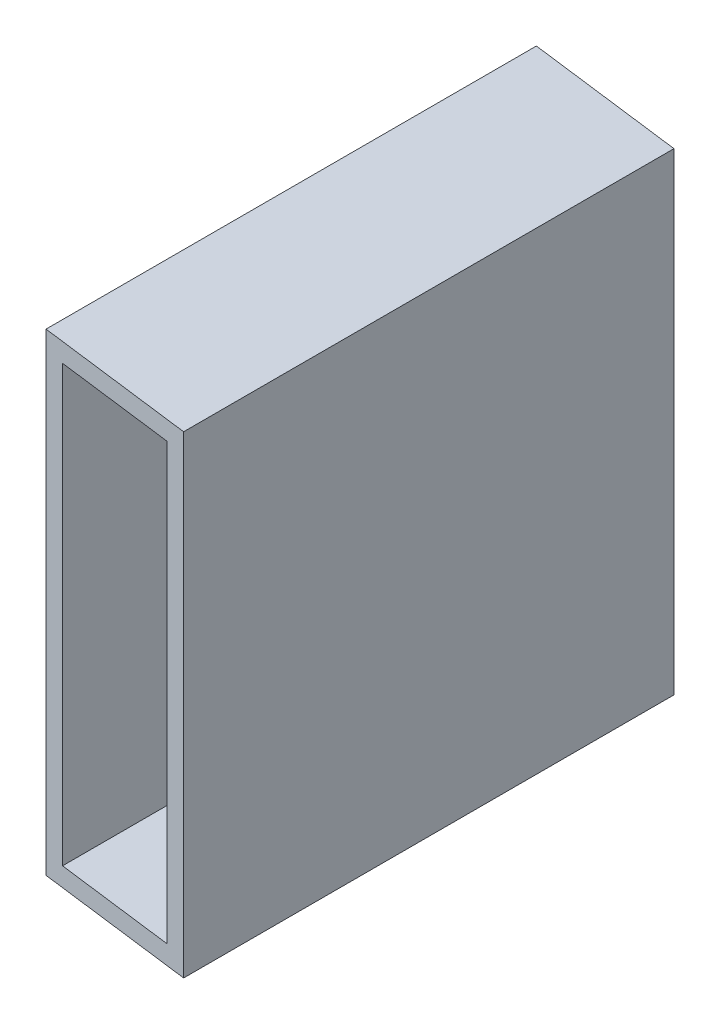
ISO-10303-21;
HEADER;
FILE_DESCRIPTION(('STEP AP214'),'2;1');
FILE_NAME('part.step','',(''),(''),'','','');
FILE_SCHEMA(('AUTOMOTIVE_DESIGN { 1 0 10303 214 1 1 1 1 }'));
ENDSEC;
DATA;
#1=APPLICATION_CONTEXT('core data for automotive mechanical design processes');
#2=APPLICATION_PROTOCOL_DEFINITION('international standard','automotive_design',2000,#1);
#3=PRODUCT_CONTEXT('',#1,'mechanical');
#4=PRODUCT('Part','Part','',(#3));
#5=PRODUCT_RELATED_PRODUCT_CATEGORY('part','',(#4));
#6=PRODUCT_DEFINITION_FORMATION('','',#4);
#7=PRODUCT_DEFINITION_CONTEXT('part definition',#1,'design');
#8=PRODUCT_DEFINITION('design','',#6,#7);
#9=PRODUCT_DEFINITION_SHAPE('','',#8);
#10=(LENGTH_UNIT() NAMED_UNIT(*) SI_UNIT(.MILLI.,.METRE.));
#11=(NAMED_UNIT(*) PLANE_ANGLE_UNIT() SI_UNIT($,.RADIAN.));
#12=(NAMED_UNIT(*) SI_UNIT($,.STERADIAN.) SOLID_ANGLE_UNIT());
#13=UNCERTAINTY_MEASURE_WITH_UNIT(LENGTH_MEASURE(1.E-05),#10,'distance_accuracy_value','');
#14=(GEOMETRIC_REPRESENTATION_CONTEXT(3) GLOBAL_UNCERTAINTY_ASSIGNED_CONTEXT((#13)) GLOBAL_UNIT_ASSIGNED_CONTEXT((#10,
#11,#12)) REPRESENTATION_CONTEXT('',''));
#15=CARTESIAN_POINT('',(0.,0.,0.));
#16=DIRECTION('',(0.,0.,1.));
#17=DIRECTION('',(1.,0.,0.));
#18=AXIS2_PLACEMENT_3D('',#15,#16,#17);
#19=CARTESIAN_POINT('',(12.7000000000001,0.,78.9851209117244));
#20=DIRECTION('',(-1.,0.,0.));
#21=DIRECTION('',(0.,-1.,0.));
#22=AXIS2_PLACEMENT_3D('',#19,#20,#21);
#23=PLANE('',#22);
#24=DIRECTION('',(0.,1.,0.));
#25=VECTOR('',#24,1.);
#26=CARTESIAN_POINT('',(12.7000000000001,0.,80.6027654223491));
#27=LINE('',#26,#25);
#28=CARTESIAN_POINT('',(12.7,-38.1,80.6027654223491));
#29=VERTEX_POINT('',#28);
#30=CARTESIAN_POINT('',(12.7,38.1,80.6027654223491));
#31=VERTEX_POINT('',#30);
#32=EDGE_CURVE('E99',#29,#31,#27,.T.);
#33=ORIENTED_EDGE('',*,*,#32,.F.);
#34=DIRECTION('',(0.,0.,-1.));
#35=VECTOR('',#34,1.);
#36=CARTESIAN_POINT('',(12.7,-38.1,78.9851209117244));
#37=LINE('',#36,#35);
#38=CARTESIAN_POINT('',(12.7,-38.1,1.61764451062471));
#39=VERTEX_POINT('',#38);
#40=EDGE_CURVE('E109',#29,#39,#37,.T.);
#41=ORIENTED_EDGE('',*,*,#40,.T.);
#42=DIRECTION('',(0.,-1.,0.));
#43=VECTOR('',#42,1.);
#44=CARTESIAN_POINT('',(12.7000000000001,0.,1.61764451062471));
#45=LINE('',#44,#43);
#46=CARTESIAN_POINT('',(12.7,38.1,1.6176445106247));
#47=VERTEX_POINT('',#46);
#48=EDGE_CURVE('E156',#47,#39,#45,.T.);
#49=ORIENTED_EDGE('',*,*,#48,.F.);
#50=DIRECTION('',(0.,0.,-1.));
#51=VECTOR('',#50,1.);
#52=CARTESIAN_POINT('',(12.7,38.1,78.9851209117244));
#53=LINE('',#52,#51);
#54=EDGE_CURVE('E42',#31,#47,#53,.T.);
#55=ORIENTED_EDGE('',*,*,#54,.F.);
#56=EDGE_LOOP('',(#33,#41,#49,#55));
#57=FACE_BOUND('',#56,.T.);
#58=ADVANCED_FACE('F34',(#57),#23,.F.);
#59=CARTESIAN_POINT('',(0.,38.1,78.9851209117244));
#60=DIRECTION('',(0.,1.,0.));
#61=DIRECTION('',(0.,0.,1.));
#62=AXIS2_PLACEMENT_3D('',#59,#60,#61);
#63=PLANE('',#62);
#64=DIRECTION('',(0.,0.,-1.));
#65=VECTOR('',#64,1.);
#66=CARTESIAN_POINT('',(-12.7,38.1,78.9851209117244));
#67=LINE('',#66,#65);
#68=CARTESIAN_POINT('',(-12.7,38.1,77.3674764010997));
#69=VERTEX_POINT('',#68);
#70=CARTESIAN_POINT('',(-12.7,38.1,-1.6176445106247));
#71=VERTEX_POINT('',#70);
#72=EDGE_CURVE('E119',#69,#71,#67,.T.);
#73=ORIENTED_EDGE('',*,*,#72,.F.);
#74=DIRECTION('',(0.991985376438617,0.,0.126352732190228));
#75=VECTOR('',#74,1.);
#76=CARTESIAN_POINT('',(0.,38.1,78.9851209117244));
#77=LINE('',#76,#75);
#78=EDGE_CURVE('E112',#69,#31,#77,.T.);
#79=ORIENTED_EDGE('',*,*,#78,.T.);
#80=ORIENTED_EDGE('',*,*,#54,.T.);
#81=DIRECTION('',(0.991985376438617,0.,0.126352732190229));
#82=VECTOR('',#81,1.);
#83=CARTESIAN_POINT('',(0.,38.1,0.));
#84=LINE('',#83,#82);
#85=EDGE_CURVE('E111',#71,#47,#84,.T.);
#86=ORIENTED_EDGE('',*,*,#85,.F.);
#87=EDGE_LOOP('',(#73,#79,#80,#86));
#88=FACE_BOUND('',#87,.T.);
#89=ADVANCED_FACE('F185',(#88),#63,.T.);
#90=CARTESIAN_POINT('',(-12.7,0.,78.9851209117244));
#91=DIRECTION('',(-1.,0.,0.));
#92=DIRECTION('',(0.,0.,1.));
#93=AXIS2_PLACEMENT_3D('',#90,#91,#92);
#94=PLANE('',#93);
#95=DIRECTION('',(0.,0.,-1.));
#96=VECTOR('',#95,1.);
#97=CARTESIAN_POINT('',(-12.7,-38.1,78.9851209117244));
#98=LINE('',#97,#96);
#99=CARTESIAN_POINT('',(-12.7,-38.1,77.3674764010997));
#100=VERTEX_POINT('',#99);
#101=CARTESIAN_POINT('',(-12.7,-38.1,-1.61764451062471));
#102=VERTEX_POINT('',#101);
#103=EDGE_CURVE('E116',#100,#102,#98,.T.);
#104=ORIENTED_EDGE('',*,*,#103,.F.);
#105=DIRECTION('',(0.,1.,0.));
#106=VECTOR('',#105,1.);
#107=CARTESIAN_POINT('',(-12.7,0.,77.3674764010997));
#108=LINE('',#107,#106);
#109=EDGE_CURVE('E57',#100,#69,#108,.T.);
#110=ORIENTED_EDGE('',*,*,#109,.T.);
#111=ORIENTED_EDGE('',*,*,#72,.T.);
#112=DIRECTION('',(0.,-1.,0.));
#113=VECTOR('',#112,1.);
#114=CARTESIAN_POINT('',(-12.7,0.,-1.6176445106247));
#115=LINE('',#114,#113);
#116=EDGE_CURVE('E158',#71,#102,#115,.T.);
#117=ORIENTED_EDGE('',*,*,#116,.T.);
#118=EDGE_LOOP('',(#104,#110,#111,#117));
#119=FACE_BOUND('',#118,.T.);
#120=ADVANCED_FACE('F189',(#119),#94,.T.);
#121=CARTESIAN_POINT('',(9.652,0.,78.9851209117244));
#122=DIRECTION('',(1.,0.,0.));
#123=DIRECTION('',(0.,1.,0.));
#124=AXIS2_PLACEMENT_3D('',#121,#122,#123);
#125=PLANE('',#124);
#126=DIRECTION('',(0.,-1.,0.));
#127=VECTOR('',#126,1.);
#128=CARTESIAN_POINT('',(9.652,0.,80.2145307397992));
#129=LINE('',#128,#127);
#130=CARTESIAN_POINT('',(9.652,35.052,80.2145307397992));
#131=VERTEX_POINT('',#130);
#132=CARTESIAN_POINT('',(9.652,-35.052,80.2145307397992));
#133=VERTEX_POINT('',#132);
#134=EDGE_CURVE('E165',#131,#133,#129,.T.);
#135=ORIENTED_EDGE('',*,*,#134,.F.);
#136=DIRECTION('',(0.,0.,-1.));
#137=VECTOR('',#136,1.);
#138=CARTESIAN_POINT('',(9.65199999999999,35.052,78.9851209117244));
#139=LINE('',#138,#137);
#140=CARTESIAN_POINT('',(9.652,35.052,1.22940982807478));
#141=VERTEX_POINT('',#140);
#142=EDGE_CURVE('E128',#131,#141,#139,.T.);
#143=ORIENTED_EDGE('',*,*,#142,.T.);
#144=DIRECTION('',(0.,1.,0.));
#145=VECTOR('',#144,1.);
#146=CARTESIAN_POINT('',(9.652,0.,1.22940982807478));
#147=LINE('',#146,#145);
#148=CARTESIAN_POINT('',(9.652,-35.052,1.22940982807477));
#149=VERTEX_POINT('',#148);
#150=EDGE_CURVE('E123',#149,#141,#147,.T.);
#151=ORIENTED_EDGE('',*,*,#150,.F.);
#152=DIRECTION('',(0.,0.,-1.));
#153=VECTOR('',#152,1.);
#154=CARTESIAN_POINT('',(9.652,-35.052,78.9851209117244));
#155=LINE('',#154,#153);
#156=EDGE_CURVE('E117',#133,#149,#155,.T.);
#157=ORIENTED_EDGE('',*,*,#156,.F.);
#158=EDGE_LOOP('',(#135,#143,#151,#157));
#159=FACE_BOUND('',#158,.T.);
#160=ADVANCED_FACE('F36',(#159),#125,.F.);
#161=CARTESIAN_POINT('',(0.,-35.052,78.9851209117244));
#162=DIRECTION('',(0.,1.,0.));
#163=DIRECTION('',(-1.,0.,0.));
#164=AXIS2_PLACEMENT_3D('',#161,#162,#163);
#165=PLANE('',#164);
#166=DIRECTION('',(0.,0.,-1.));
#167=VECTOR('',#166,1.);
#168=CARTESIAN_POINT('',(-9.65199999999999,-35.052,78.9851209117244));
#169=LINE('',#168,#167);
#170=CARTESIAN_POINT('',(-9.65199999999999,-35.052,77.7557110836497));
#171=VERTEX_POINT('',#170);
#172=CARTESIAN_POINT('',(-9.65199999999999,-35.052,-1.22940982807478));
#173=VERTEX_POINT('',#172);
#174=EDGE_CURVE('E121',#171,#173,#169,.T.);
#175=ORIENTED_EDGE('',*,*,#174,.F.);
#176=DIRECTION('',(0.991985376438617,0.,0.126352732190228));
#177=VECTOR('',#176,1.);
#178=CARTESIAN_POINT('',(0.,-35.052,78.9851209117244));
#179=LINE('',#178,#177);
#180=EDGE_CURVE('E167',#171,#133,#179,.T.);
#181=ORIENTED_EDGE('',*,*,#180,.T.);
#182=ORIENTED_EDGE('',*,*,#156,.T.);
#183=DIRECTION('',(-0.991985376438617,0.,-0.126352732190229));
#184=VECTOR('',#183,1.);
#185=CARTESIAN_POINT('',(9.9,-35.052,1.26099847678618));
#186=LINE('',#185,#184);
#187=EDGE_CURVE('E147',#149,#173,#186,.T.);
#188=ORIENTED_EDGE('',*,*,#187,.T.);
#189=EDGE_LOOP('',(#175,#181,#182,#188));
#190=FACE_BOUND('',#189,.T.);
#191=ADVANCED_FACE('F152',(#190),#165,.T.);
#192=CARTESIAN_POINT('',(-9.65199999999999,0.,78.9851209117244));
#193=DIRECTION('',(1.,0.,0.));
#194=DIRECTION('',(0.,1.,0.));
#195=AXIS2_PLACEMENT_3D('',#192,#193,#194);
#196=PLANE('',#195);
#197=DIRECTION('',(0.,0.,-1.));
#198=VECTOR('',#197,1.);
#199=CARTESIAN_POINT('',(-9.65199999999999,35.052,78.9851209117244));
#200=LINE('',#199,#198);
#201=CARTESIAN_POINT('',(-9.65199999999999,35.052,77.7557110836497));
#202=VERTEX_POINT('',#201);
#203=CARTESIAN_POINT('',(-9.65199999999999,35.052,-1.22940982807478));
#204=VERTEX_POINT('',#203);
#205=EDGE_CURVE('E130',#202,#204,#200,.T.);
#206=ORIENTED_EDGE('',*,*,#205,.F.);
#207=DIRECTION('',(0.,-1.,0.));
#208=VECTOR('',#207,1.);
#209=CARTESIAN_POINT('',(-9.65199999999999,0.,77.7557110836497));
#210=LINE('',#209,#208);
#211=EDGE_CURVE('E49',#202,#171,#210,.T.);
#212=ORIENTED_EDGE('',*,*,#211,.T.);
#213=ORIENTED_EDGE('',*,*,#174,.T.);
#214=DIRECTION('',(0.,1.,0.));
#215=VECTOR('',#214,1.);
#216=CARTESIAN_POINT('',(-9.65199999999999,0.,-1.22940982807478));
#217=LINE('',#216,#215);
#218=EDGE_CURVE('E138',#173,#204,#217,.T.);
#219=ORIENTED_EDGE('',*,*,#218,.T.);
#220=EDGE_LOOP('',(#206,#212,#213,#219));
#221=FACE_BOUND('',#220,.T.);
#222=ADVANCED_FACE('F137',(#221),#196,.T.);
#223=CARTESIAN_POINT('',(0.,35.052,78.9851209117244));
#224=DIRECTION('',(0.,1.,0.));
#225=DIRECTION('',(0.,0.,1.));
#226=AXIS2_PLACEMENT_3D('',#223,#224,#225);
#227=PLANE('',#226);
#228=DIRECTION('',(0.991985376438617,0.,0.126352732190228));
#229=VECTOR('',#228,1.);
#230=CARTESIAN_POINT('',(0.,35.052,78.9851209117244));
#231=LINE('',#230,#229);
#232=EDGE_CURVE('E104',#202,#131,#231,.T.);
#233=ORIENTED_EDGE('',*,*,#232,.F.);
#234=ORIENTED_EDGE('',*,*,#205,.T.);
#235=DIRECTION('',(-0.991985376438617,0.,-0.126352732190229));
#236=VECTOR('',#235,1.);
#237=CARTESIAN_POINT('',(9.90000000000001,35.052,1.26099847678618));
#238=LINE('',#237,#236);
#239=EDGE_CURVE('E150',#141,#204,#238,.T.);
#240=ORIENTED_EDGE('',*,*,#239,.F.);
#241=ORIENTED_EDGE('',*,*,#142,.F.);
#242=EDGE_LOOP('',(#233,#234,#240,#241));
#243=FACE_BOUND('',#242,.T.);
#244=ADVANCED_FACE('F174',(#243),#227,.F.);
#245=CARTESIAN_POINT('',(0.,-38.1,78.9851209117244));
#246=DIRECTION('',(0.,-1.,0.));
#247=DIRECTION('',(0.,0.,-1.));
#248=AXIS2_PLACEMENT_3D('',#245,#246,#247);
#249=PLANE('',#248);
#250=ORIENTED_EDGE('',*,*,#40,.F.);
#251=DIRECTION('',(0.991985376438617,0.,0.126352732190228));
#252=VECTOR('',#251,1.);
#253=CARTESIAN_POINT('',(-9.89999999999996,-38.1,77.7241224349383));
#254=LINE('',#253,#252);
#255=EDGE_CURVE('E96',#100,#29,#254,.T.);
#256=ORIENTED_EDGE('',*,*,#255,.F.);
#257=ORIENTED_EDGE('',*,*,#103,.T.);
#258=DIRECTION('',(0.991985376438617,0.,0.126352732190229));
#259=VECTOR('',#258,1.);
#260=CARTESIAN_POINT('',(9.90000000000001,-38.1,1.26099847678618));
#261=LINE('',#260,#259);
#262=EDGE_CURVE('E11',#102,#39,#261,.T.);
#263=ORIENTED_EDGE('',*,*,#262,.T.);
#264=EDGE_LOOP('',(#250,#256,#257,#263));
#265=FACE_BOUND('',#264,.T.);
#266=ADVANCED_FACE('F114',(#265),#249,.T.);
#267=CARTESIAN_POINT('',(0.,38.1,0.));
#268=DIRECTION('',(0.126352732190229,0.,-0.991985376438617));
#269=DIRECTION('',(-0.991985376438617,0.,-0.126352732190229));
#270=AXIS2_PLACEMENT_3D('',#267,#268,#269);
#271=PLANE('',#270);
#272=ORIENTED_EDGE('',*,*,#48,.T.);
#273=ORIENTED_EDGE('',*,*,#262,.F.);
#274=ORIENTED_EDGE('',*,*,#116,.F.);
#275=ORIENTED_EDGE('',*,*,#85,.T.);
#276=EDGE_LOOP('',(#272,#273,#274,#275));
#277=FACE_BOUND('',#276,.T.);
#278=ORIENTED_EDGE('',*,*,#150,.T.);
#279=ORIENTED_EDGE('',*,*,#239,.T.);
#280=ORIENTED_EDGE('',*,*,#218,.F.);
#281=ORIENTED_EDGE('',*,*,#187,.F.);
#282=EDGE_LOOP('',(#278,#279,#280,#281));
#283=FACE_BOUND('',#282,.T.);
#284=ADVANCED_FACE('F146',(#277,#283),#271,.T.);
#285=CARTESIAN_POINT('',(-9.89999999999996,-38.1,77.7241224349383));
#286=DIRECTION('',(-0.126352732190228,0.,0.991985376438617));
#287=DIRECTION('',(0.991985376438617,0.,0.126352732190228));
#288=AXIS2_PLACEMENT_3D('',#285,#286,#287);
#289=PLANE('',#288);
#290=ORIENTED_EDGE('',*,*,#134,.T.);
#291=ORIENTED_EDGE('',*,*,#180,.F.);
#292=ORIENTED_EDGE('',*,*,#211,.F.);
#293=ORIENTED_EDGE('',*,*,#232,.T.);
#294=EDGE_LOOP('',(#290,#291,#292,#293));
#295=FACE_BOUND('',#294,.T.);
#296=ORIENTED_EDGE('',*,*,#32,.T.);
#297=ORIENTED_EDGE('',*,*,#78,.F.);
#298=ORIENTED_EDGE('',*,*,#109,.F.);
#299=ORIENTED_EDGE('',*,*,#255,.T.);
#300=EDGE_LOOP('',(#296,#297,#298,#299));
#301=FACE_BOUND('',#300,.T.);
#302=ADVANCED_FACE('F98',(#295,#301),#289,.T.);
#303=CLOSED_SHELL('',(#58,#89,#120,#160,#191,#222,#244,#266,#284,#302));
#304=MANIFOLD_SOLID_BREP('B2',#303);
#305=ADVANCED_BREP_SHAPE_REPRESENTATION('',(#18,#304),#14);
#306=SHAPE_DEFINITION_REPRESENTATION(#9,#305);
ENDSEC;
END-ISO-10303-21;
